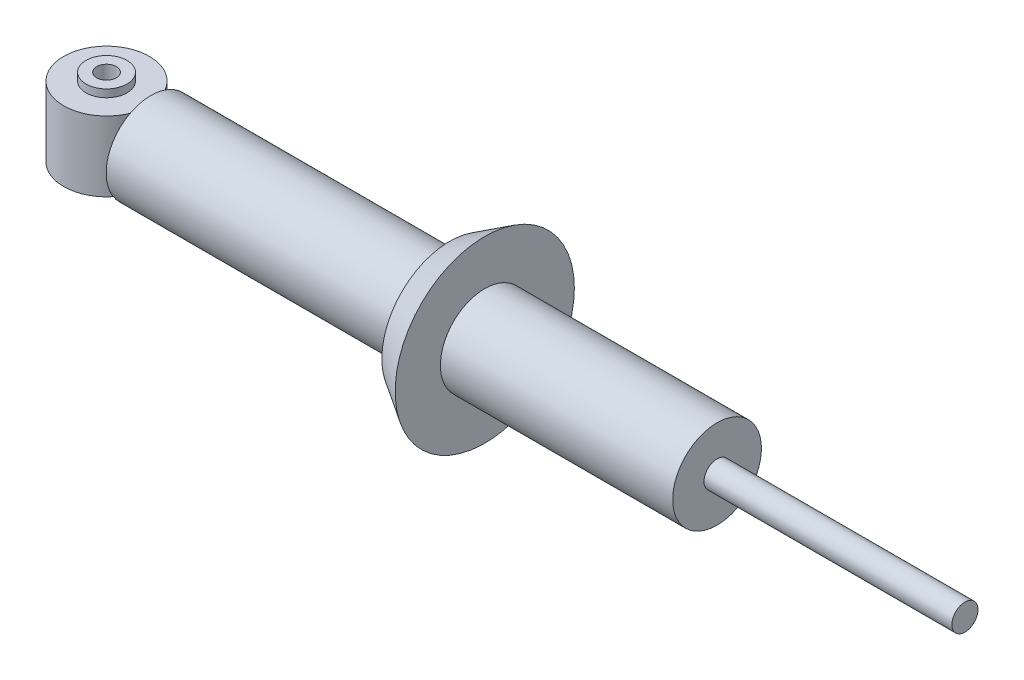
ISO-10303-21;
HEADER;
FILE_DESCRIPTION(('STEP AP214'),'2;1');
FILE_NAME('part.step','',(''),(''),'','','');
FILE_SCHEMA(('AUTOMOTIVE_DESIGN { 1 0 10303 214 1 1 1 1 }'));
ENDSEC;
DATA;
#1=APPLICATION_CONTEXT('core data for automotive mechanical design processes');
#2=APPLICATION_PROTOCOL_DEFINITION('international standard','automotive_design',2000,#1);
#3=PRODUCT_CONTEXT('',#1,'mechanical');
#4=PRODUCT('Part','Part','',(#3));
#5=PRODUCT_RELATED_PRODUCT_CATEGORY('part','',(#4));
#6=PRODUCT_DEFINITION_FORMATION('','',#4);
#7=PRODUCT_DEFINITION_CONTEXT('part definition',#1,'design');
#8=PRODUCT_DEFINITION('design','',#6,#7);
#9=PRODUCT_DEFINITION_SHAPE('','',#8);
#10=(LENGTH_UNIT() NAMED_UNIT(*) SI_UNIT(.MILLI.,.METRE.));
#11=(NAMED_UNIT(*) PLANE_ANGLE_UNIT() SI_UNIT($,.RADIAN.));
#12=(NAMED_UNIT(*) SI_UNIT($,.STERADIAN.) SOLID_ANGLE_UNIT());
#13=UNCERTAINTY_MEASURE_WITH_UNIT(LENGTH_MEASURE(1.E-05),#10,'distance_accuracy_value','');
#14=(GEOMETRIC_REPRESENTATION_CONTEXT(3) GLOBAL_UNCERTAINTY_ASSIGNED_CONTEXT((#13)) GLOBAL_UNIT_ASSIGNED_CONTEXT((#10,
#11,#12)) REPRESENTATION_CONTEXT('',''));
#15=CARTESIAN_POINT('',(0.,0.,0.));
#16=DIRECTION('',(0.,0.,1.));
#17=DIRECTION('',(1.,0.,0.));
#18=AXIS2_PLACEMENT_3D('',#15,#16,#17);
#19=CARTESIAN_POINT('',(26.,0.,0.));
#20=DIRECTION('',(1.,0.,0.));
#21=DIRECTION('',(0.,0.,-1.));
#22=AXIS2_PLACEMENT_3D('',#19,#20,#21);
#23=CYLINDRICAL_SURFACE('',#22,26.2);
#24=CARTESIAN_POINT('',(26.,0.,0.));
#25=DIRECTION('',(1.,0.,0.));
#26=DIRECTION('',(0.,0.,-1.));
#27=AXIS2_PLACEMENT_3D('',#24,#25,#26);
#28=CIRCLE('',#27,26.2);
#29=CARTESIAN_POINT('',(26.,0.,-26.2));
#30=VERTEX_POINT('',#29);
#31=EDGE_CURVE('E12',#30,#30,#28,.T.);
#32=ORIENTED_EDGE('',*,*,#31,.T.);
#33=EDGE_LOOP('',(#32));
#34=FACE_BOUND('',#33,.T.);
#35=CARTESIAN_POINT('',(201.,0.,0.));
#36=DIRECTION('',(1.,0.,0.));
#37=DIRECTION('',(0.,0.,-1.));
#38=AXIS2_PLACEMENT_3D('',#35,#36,#37);
#39=CIRCLE('',#38,26.2);
#40=CARTESIAN_POINT('',(201.,0.,-26.2));
#41=VERTEX_POINT('',#40);
#42=EDGE_CURVE('E50',#41,#41,#39,.T.);
#43=ORIENTED_EDGE('',*,*,#42,.F.);
#44=EDGE_LOOP('',(#43));
#45=FACE_BOUND('',#44,.T.);
#46=ADVANCED_FACE('F47',(#34,#45),#23,.T.);
#47=CARTESIAN_POINT('',(26.,0.,0.));
#48=DIRECTION('',(1.,0.,0.));
#49=DIRECTION('',(0.,0.,-1.));
#50=AXIS2_PLACEMENT_3D('',#47,#48,#49);
#51=PLANE('',#50);
#52=ORIENTED_EDGE('',*,*,#31,.F.);
#53=EDGE_LOOP('',(#52));
#54=FACE_BOUND('',#53,.T.);
#55=ADVANCED_FACE('F79',(#54),#51,.F.);
#56=CARTESIAN_POINT('',(221.6,0.,0.));
#57=DIRECTION('',(1.,0.,0.));
#58=DIRECTION('',(0.,0.,-1.));
#59=AXIS2_PLACEMENT_3D('',#56,#57,#58);
#60=PLANE('',#59);
#61=CARTESIAN_POINT('',(221.6,0.,0.));
#62=DIRECTION('',(1.,0.,0.));
#63=DIRECTION('',(0.,0.,-1.));
#64=AXIS2_PLACEMENT_3D('',#61,#62,#63);
#65=CIRCLE('',#64,26.);
#66=CARTESIAN_POINT('',(221.6,0.,-26.));
#67=VERTEX_POINT('',#66);
#68=EDGE_CURVE('E101',#67,#67,#65,.T.);
#69=ORIENTED_EDGE('',*,*,#68,.F.);
#70=EDGE_LOOP('',(#69));
#71=FACE_BOUND('',#70,.T.);
#72=CARTESIAN_POINT('',(221.6,0.,0.));
#73=DIRECTION('',(1.,0.,0.));
#74=DIRECTION('',(0.,0.,-1.));
#75=AXIS2_PLACEMENT_3D('',#72,#73,#74);
#76=CIRCLE('',#75,52.5);
#77=CARTESIAN_POINT('',(221.6,0.,-52.5));
#78=VERTEX_POINT('',#77);
#79=EDGE_CURVE('E57',#78,#78,#76,.T.);
#80=ORIENTED_EDGE('',*,*,#79,.T.);
#81=EDGE_LOOP('',(#80));
#82=FACE_BOUND('',#81,.T.);
#83=ADVANCED_FACE('F69',(#71,#82),#60,.T.);
#84=CARTESIAN_POINT('',(201.,0.,0.));
#85=DIRECTION('',(1.,0.,0.));
#86=DIRECTION('',(0.,0.,-1.));
#87=AXIS2_PLACEMENT_3D('',#84,#85,#86);
#88=PLANE('',#87);
#89=ORIENTED_EDGE('',*,*,#42,.T.);
#90=EDGE_LOOP('',(#89));
#91=FACE_BOUND('',#90,.T.);
#92=CARTESIAN_POINT('',(201.,0.,0.));
#93=DIRECTION('',(1.,0.,0.));
#94=DIRECTION('',(0.,0.,-1.));
#95=AXIS2_PLACEMENT_3D('',#92,#93,#94);
#96=CIRCLE('',#95,39.7);
#97=CARTESIAN_POINT('',(201.,0.,-39.7));
#98=VERTEX_POINT('',#97);
#99=EDGE_CURVE('E63',#98,#98,#96,.T.);
#100=ORIENTED_EDGE('',*,*,#99,.F.);
#101=EDGE_LOOP('',(#100));
#102=FACE_BOUND('',#101,.T.);
#103=ADVANCED_FACE('F78',(#91,#102),#88,.F.);
#104=CARTESIAN_POINT('',(201.,0.,0.));
#105=DIRECTION('',(1.,0.,0.));
#106=DIRECTION('',(0.,0.,-1.));
#107=AXIS2_PLACEMENT_3D('',#104,#105,#106);
#108=CONICAL_SURFACE('',#107,39.7,0.555976943732405);
#109=ORIENTED_EDGE('',*,*,#99,.T.);
#110=EDGE_LOOP('',(#109));
#111=FACE_BOUND('',#110,.T.);
#112=ORIENTED_EDGE('',*,*,#79,.F.);
#113=EDGE_LOOP('',(#112));
#114=FACE_BOUND('',#113,.T.);
#115=ADVANCED_FACE('F81',(#111,#114),#108,.T.);
#116=CARTESIAN_POINT('',(357.7,0.,0.));
#117=DIRECTION('',(-1.,0.,0.));
#118=DIRECTION('',(0.,0.,1.));
#119=AXIS2_PLACEMENT_3D('',#116,#117,#118);
#120=CYLINDRICAL_SURFACE('',#119,26.);
#121=CARTESIAN_POINT('',(357.7,0.,0.));
#122=DIRECTION('',(1.,0.,0.));
#123=DIRECTION('',(0.,0.,-1.));
#124=AXIS2_PLACEMENT_3D('',#121,#122,#123);
#125=CIRCLE('',#124,26.);
#126=CARTESIAN_POINT('',(357.7,0.,-26.));
#127=VERTEX_POINT('',#126);
#128=EDGE_CURVE('E99',#127,#127,#125,.T.);
#129=ORIENTED_EDGE('',*,*,#128,.F.);
#130=EDGE_LOOP('',(#129));
#131=FACE_BOUND('',#130,.T.);
#132=ORIENTED_EDGE('',*,*,#68,.T.);
#133=EDGE_LOOP('',(#132));
#134=FACE_BOUND('',#133,.T.);
#135=ADVANCED_FACE('F135',(#131,#134),#120,.T.);
#136=CARTESIAN_POINT('',(357.7,0.,0.));
#137=DIRECTION('',(1.,0.,0.));
#138=DIRECTION('',(0.,0.,-1.));
#139=AXIS2_PLACEMENT_3D('',#136,#137,#138);
#140=PLANE('',#139);
#141=CARTESIAN_POINT('',(357.7,0.,0.));
#142=DIRECTION('',(1.,0.,0.));
#143=DIRECTION('',(0.,0.,-1.));
#144=AXIS2_PLACEMENT_3D('',#141,#142,#143);
#145=CIRCLE('',#144,7.65);
#146=CARTESIAN_POINT('',(357.7,0.,-7.65));
#147=VERTEX_POINT('',#146);
#148=EDGE_CURVE('E118',#147,#147,#145,.T.);
#149=ORIENTED_EDGE('',*,*,#148,.F.);
#150=EDGE_LOOP('',(#149));
#151=FACE_BOUND('',#150,.T.);
#152=ORIENTED_EDGE('',*,*,#128,.T.);
#153=EDGE_LOOP('',(#152));
#154=FACE_BOUND('',#153,.T.);
#155=ADVANCED_FACE('F129',(#151,#154),#140,.T.);
#156=CARTESIAN_POINT('',(502.93,0.,0.));
#157=DIRECTION('',(-1.,0.,0.));
#158=DIRECTION('',(0.,0.,1.));
#159=AXIS2_PLACEMENT_3D('',#156,#157,#158);
#160=CYLINDRICAL_SURFACE('',#159,7.65);
#161=CARTESIAN_POINT('',(502.93,0.,0.));
#162=DIRECTION('',(1.,0.,0.));
#163=DIRECTION('',(0.,0.,-1.));
#164=AXIS2_PLACEMENT_3D('',#161,#162,#163);
#165=CIRCLE('',#164,7.65);
#166=CARTESIAN_POINT('',(502.93,0.,-7.65));
#167=VERTEX_POINT('',#166);
#168=EDGE_CURVE('E116',#167,#167,#165,.T.);
#169=ORIENTED_EDGE('',*,*,#168,.F.);
#170=EDGE_LOOP('',(#169));
#171=FACE_BOUND('',#170,.T.);
#172=ORIENTED_EDGE('',*,*,#148,.T.);
#173=EDGE_LOOP('',(#172));
#174=FACE_BOUND('',#173,.T.);
#175=ADVANCED_FACE('F126',(#171,#174),#160,.T.);
#176=CARTESIAN_POINT('',(502.93,0.,0.));
#177=DIRECTION('',(1.,0.,0.));
#178=DIRECTION('',(0.,0.,-1.));
#179=AXIS2_PLACEMENT_3D('',#176,#177,#178);
#180=PLANE('',#179);
#181=ORIENTED_EDGE('',*,*,#168,.T.);
#182=EDGE_LOOP('',(#181));
#183=FACE_BOUND('',#182,.T.);
#184=ADVANCED_FACE('F124',(#183),#180,.T.);
#185=CLOSED_SHELL('',(#46,#55,#83,#103,#115,#135,#155,#175,#184));
#186=MANIFOLD_SOLID_BREP('B2',#185);
#187=CARTESIAN_POINT('',(0.,58.9394201686436,0.));
#188=DIRECTION('',(0.,1.,0.));
#189=DIRECTION('',(0.,0.,1.));
#190=AXIS2_PLACEMENT_3D('',#187,#188,#189);
#191=CYLINDRICAL_SURFACE('',#190,5.75);
#192=CARTESIAN_POINT('',(0.,25.,0.));
#193=DIRECTION('',(0.,1.,0.));
#194=DIRECTION('',(0.,0.,1.));
#195=AXIS2_PLACEMENT_3D('',#192,#193,#194);
#196=CIRCLE('',#195,5.75);
#197=CARTESIAN_POINT('',(0.,25.,5.75));
#198=VERTEX_POINT('',#197);
#199=EDGE_CURVE('E264',#198,#198,#196,.T.);
#200=ORIENTED_EDGE('',*,*,#199,.T.);
#201=EDGE_LOOP('',(#200));
#202=FACE_BOUND('',#201,.T.);
#203=CARTESIAN_POINT('',(0.,-25.,0.));
#204=DIRECTION('',(0.,1.,0.));
#205=DIRECTION('',(0.,0.,1.));
#206=AXIS2_PLACEMENT_3D('',#203,#204,#205);
#207=CIRCLE('',#206,5.75);
#208=CARTESIAN_POINT('',(0.,-25.,5.75));
#209=VERTEX_POINT('',#208);
#210=EDGE_CURVE('E288',#209,#209,#207,.T.);
#211=ORIENTED_EDGE('',*,*,#210,.F.);
#212=EDGE_LOOP('',(#211));
#213=FACE_BOUND('',#212,.T.);
#214=ADVANCED_FACE('F200',(#202,#213),#191,.F.);
#215=CARTESIAN_POINT('',(-5.75,-25.,0.));
#216=DIRECTION('',(0.,-1.,0.));
#217=DIRECTION('',(0.,0.,-1.));
#218=AXIS2_PLACEMENT_3D('',#215,#216,#217);
#219=PLANE('',#218);
#220=ORIENTED_EDGE('',*,*,#210,.T.);
#221=EDGE_LOOP('',(#220));
#222=FACE_BOUND('',#221,.T.);
#223=CARTESIAN_POINT('',(0.,-25.,0.));
#224=DIRECTION('',(0.,1.,0.));
#225=DIRECTION('',(0.,0.,1.));
#226=AXIS2_PLACEMENT_3D('',#223,#224,#225);
#227=CIRCLE('',#226,12.);
#228=CARTESIAN_POINT('',(0.,-25.,12.));
#229=VERTEX_POINT('',#228);
#230=EDGE_CURVE('E285',#229,#229,#227,.T.);
#231=ORIENTED_EDGE('',*,*,#230,.F.);
#232=EDGE_LOOP('',(#231));
#233=FACE_BOUND('',#232,.T.);
#234=ADVANCED_FACE('F328',(#222,#233),#219,.T.);
#235=CARTESIAN_POINT('',(0.,58.9394201686436,0.));
#236=DIRECTION('',(0.,1.,0.));
#237=DIRECTION('',(0.,0.,1.));
#238=AXIS2_PLACEMENT_3D('',#235,#236,#237);
#239=CYLINDRICAL_SURFACE('',#238,12.);
#240=ORIENTED_EDGE('',*,*,#230,.T.);
#241=EDGE_LOOP('',(#240));
#242=FACE_BOUND('',#241,.T.);
#243=CARTESIAN_POINT('',(0.,-20.5,0.));
#244=DIRECTION('',(0.,1.,0.));
#245=DIRECTION('',(0.,0.,1.));
#246=AXIS2_PLACEMENT_3D('',#243,#244,#245);
#247=CIRCLE('',#246,12.);
#248=CARTESIAN_POINT('',(0.,-20.5,12.));
#249=VERTEX_POINT('',#248);
#250=EDGE_CURVE('E282',#249,#249,#247,.T.);
#251=ORIENTED_EDGE('',*,*,#250,.F.);
#252=EDGE_LOOP('',(#251));
#253=FACE_BOUND('',#252,.T.);
#254=ADVANCED_FACE('F333',(#242,#253),#239,.T.);
#255=CARTESIAN_POINT('',(-12.,-20.5,0.));
#256=DIRECTION('',(0.,-1.,0.));
#257=DIRECTION('',(0.,0.,-1.));
#258=AXIS2_PLACEMENT_3D('',#255,#256,#257);
#259=PLANE('',#258);
#260=ORIENTED_EDGE('',*,*,#250,.T.);
#261=EDGE_LOOP('',(#260));
#262=FACE_BOUND('',#261,.T.);
#263=CARTESIAN_POINT('',(0.,-20.5,0.));
#264=DIRECTION('',(0.,1.,0.));
#265=DIRECTION('',(0.,0.,1.));
#266=AXIS2_PLACEMENT_3D('',#263,#264,#265);
#267=CIRCLE('',#266,25.1);
#268=CARTESIAN_POINT('',(0.,-20.5,25.1));
#269=VERTEX_POINT('',#268);
#270=EDGE_CURVE('E279',#269,#269,#267,.T.);
#271=ORIENTED_EDGE('',*,*,#270,.F.);
#272=EDGE_LOOP('',(#271));
#273=FACE_BOUND('',#272,.T.);
#274=ADVANCED_FACE('F303',(#262,#273),#259,.T.);
#275=CARTESIAN_POINT('',(0.,58.9394201686436,0.));
#276=DIRECTION('',(0.,1.,0.));
#277=DIRECTION('',(0.,0.,1.));
#278=AXIS2_PLACEMENT_3D('',#275,#276,#277);
#279=CYLINDRICAL_SURFACE('',#278,25.1);
#280=CARTESIAN_POINT('',(0.,10.,0.));
#281=DIRECTION('',(0.,1.,0.));
#282=DIRECTION('',(0.,0.,1.));
#283=AXIS2_PLACEMENT_3D('',#280,#281,#282);
#284=CIRCLE('',#283,25.1);
#285=CARTESIAN_POINT('',(23.0219460515396,10.,-9.99999999999999));
#286=VERTEX_POINT('',#285);
#287=CARTESIAN_POINT('',(23.0219460515396,10.,10.));
#288=VERTEX_POINT('',#287);
#289=EDGE_CURVE('E45',#286,#288,#284,.F.);
#290=ORIENTED_EDGE('',*,*,#289,.F.);
#291=DIRECTION('',(0.,1.,0.));
#292=VECTOR('',#291,1.);
#293=CARTESIAN_POINT('',(23.0219460515396,58.9394201686436,-9.99999999999999));
#294=LINE('',#293,#292);
#295=CARTESIAN_POINT('',(23.0219460515396,-10.,-10.));
#296=VERTEX_POINT('',#295);
#297=EDGE_CURVE('E207',#296,#286,#294,.T.);
#298=ORIENTED_EDGE('',*,*,#297,.F.);
#299=CARTESIAN_POINT('',(0.,-10.,0.));
#300=DIRECTION('',(0.,-1.,0.));
#301=DIRECTION('',(0.,0.,-1.));
#302=AXIS2_PLACEMENT_3D('',#299,#300,#301);
#303=CIRCLE('',#302,25.1);
#304=CARTESIAN_POINT('',(23.0219460515396,-10.,10.));
#305=VERTEX_POINT('',#304);
#306=EDGE_CURVE('E293',#305,#296,#303,.F.);
#307=ORIENTED_EDGE('',*,*,#306,.F.);
#308=DIRECTION('',(0.,1.,0.));
#309=VECTOR('',#308,1.);
#310=CARTESIAN_POINT('',(23.0219460515396,58.9394201686436,10.));
#311=LINE('',#310,#309);
#312=EDGE_CURVE('E291',#288,#305,#311,.F.);
#313=ORIENTED_EDGE('',*,*,#312,.F.);
#314=EDGE_LOOP('',(#290,#298,#307,#313));
#315=FACE_BOUND('',#314,.T.);
#316=ORIENTED_EDGE('',*,*,#270,.T.);
#317=EDGE_LOOP('',(#316));
#318=FACE_BOUND('',#317,.T.);
#319=CARTESIAN_POINT('',(0.,20.5,0.));
#320=DIRECTION('',(0.,1.,0.));
#321=DIRECTION('',(0.,0.,1.));
#322=AXIS2_PLACEMENT_3D('',#319,#320,#321);
#323=CIRCLE('',#322,25.1);
#324=CARTESIAN_POINT('',(0.,20.5,25.1));
#325=VERTEX_POINT('',#324);
#326=EDGE_CURVE('E276',#325,#325,#323,.T.);
#327=ORIENTED_EDGE('',*,*,#326,.F.);
#328=EDGE_LOOP('',(#327));
#329=FACE_BOUND('',#328,.T.);
#330=ADVANCED_FACE('F299',(#315,#318,#329),#279,.T.);
#331=CARTESIAN_POINT('',(-12.,20.5,0.));
#332=DIRECTION('',(0.,1.,0.));
#333=DIRECTION('',(0.,0.,1.));
#334=AXIS2_PLACEMENT_3D('',#331,#332,#333);
#335=PLANE('',#334);
#336=ORIENTED_EDGE('',*,*,#326,.T.);
#337=EDGE_LOOP('',(#336));
#338=FACE_BOUND('',#337,.T.);
#339=CARTESIAN_POINT('',(0.,20.5,0.));
#340=DIRECTION('',(0.,1.,0.));
#341=DIRECTION('',(0.,0.,1.));
#342=AXIS2_PLACEMENT_3D('',#339,#340,#341);
#343=CIRCLE('',#342,12.);
#344=CARTESIAN_POINT('',(0.,20.5,12.));
#345=VERTEX_POINT('',#344);
#346=EDGE_CURVE('E273',#345,#345,#343,.T.);
#347=ORIENTED_EDGE('',*,*,#346,.F.);
#348=EDGE_LOOP('',(#347));
#349=FACE_BOUND('',#348,.T.);
#350=ADVANCED_FACE('F302',(#338,#349),#335,.T.);
#351=CARTESIAN_POINT('',(0.,58.9394201686436,0.));
#352=DIRECTION('',(0.,1.,0.));
#353=DIRECTION('',(0.,0.,1.));
#354=AXIS2_PLACEMENT_3D('',#351,#352,#353);
#355=CYLINDRICAL_SURFACE('',#354,12.);
#356=ORIENTED_EDGE('',*,*,#346,.T.);
#357=EDGE_LOOP('',(#356));
#358=FACE_BOUND('',#357,.T.);
#359=CARTESIAN_POINT('',(0.,25.,0.));
#360=DIRECTION('',(0.,1.,0.));
#361=DIRECTION('',(0.,0.,1.));
#362=AXIS2_PLACEMENT_3D('',#359,#360,#361);
#363=CIRCLE('',#362,12.);
#364=CARTESIAN_POINT('',(0.,25.,12.));
#365=VERTEX_POINT('',#364);
#366=EDGE_CURVE('E270',#365,#365,#363,.T.);
#367=ORIENTED_EDGE('',*,*,#366,.F.);
#368=EDGE_LOOP('',(#367));
#369=FACE_BOUND('',#368,.T.);
#370=ADVANCED_FACE('F311',(#358,#369),#355,.T.);
#371=CARTESIAN_POINT('',(-5.75,25.,0.));
#372=DIRECTION('',(0.,1.,0.));
#373=DIRECTION('',(0.,0.,1.));
#374=AXIS2_PLACEMENT_3D('',#371,#372,#373);
#375=PLANE('',#374);
#376=ORIENTED_EDGE('',*,*,#366,.T.);
#377=EDGE_LOOP('',(#376));
#378=FACE_BOUND('',#377,.T.);
#379=ORIENTED_EDGE('',*,*,#199,.F.);
#380=EDGE_LOOP('',(#379));
#381=FACE_BOUND('',#380,.T.);
#382=ADVANCED_FACE('F317',(#378,#381),#375,.T.);
#383=CARTESIAN_POINT('',(23.,10.,10.));
#384=DIRECTION('',(0.,1.,0.));
#385=DIRECTION('',(0.,0.,1.));
#386=AXIS2_PLACEMENT_3D('',#383,#384,#385);
#387=PLANE('',#386);
#388=DIRECTION('',(1.,0.,0.));
#389=VECTOR('',#388,1.);
#390=CARTESIAN_POINT('',(23.,10.,-10.));
#391=LINE('',#390,#389);
#392=CARTESIAN_POINT('',(26.,10.,-10.));
#393=VERTEX_POINT('',#392);
#394=EDGE_CURVE('E262',#286,#393,#391,.T.);
#395=ORIENTED_EDGE('',*,*,#394,.F.);
#396=ORIENTED_EDGE('',*,*,#289,.T.);
#397=DIRECTION('',(1.,0.,0.));
#398=VECTOR('',#397,1.);
#399=CARTESIAN_POINT('',(23.,10.,10.));
#400=LINE('',#399,#398);
#401=CARTESIAN_POINT('',(26.,10.,10.));
#402=VERTEX_POINT('',#401);
#403=EDGE_CURVE('E235',#288,#402,#400,.T.);
#404=ORIENTED_EDGE('',*,*,#403,.T.);
#405=DIRECTION('',(0.,0.,1.));
#406=VECTOR('',#405,1.);
#407=CARTESIAN_POINT('',(26.,10.,10.));
#408=LINE('',#407,#406);
#409=EDGE_CURVE('E240',#393,#402,#408,.T.);
#410=ORIENTED_EDGE('',*,*,#409,.F.);
#411=EDGE_LOOP('',(#395,#396,#404,#410));
#412=FACE_BOUND('',#411,.T.);
#413=ADVANCED_FACE('F238',(#412),#387,.T.);
#414=CARTESIAN_POINT('',(23.,10.,-10.));
#415=DIRECTION('',(0.,0.,-1.));
#416=DIRECTION('',(0.,1.,0.));
#417=AXIS2_PLACEMENT_3D('',#414,#415,#416);
#418=PLANE('',#417);
#419=DIRECTION('',(1.,0.,0.));
#420=VECTOR('',#419,1.);
#421=CARTESIAN_POINT('',(23.,-10.,-10.));
#422=LINE('',#421,#420);
#423=CARTESIAN_POINT('',(26.,-10.,-10.));
#424=VERTEX_POINT('',#423);
#425=EDGE_CURVE('E265',#296,#424,#422,.T.);
#426=ORIENTED_EDGE('',*,*,#425,.F.);
#427=ORIENTED_EDGE('',*,*,#297,.T.);
#428=ORIENTED_EDGE('',*,*,#394,.T.);
#429=DIRECTION('',(0.,1.,0.));
#430=VECTOR('',#429,1.);
#431=CARTESIAN_POINT('',(26.,10.,-10.));
#432=LINE('',#431,#430);
#433=EDGE_CURVE('E245',#424,#393,#432,.T.);
#434=ORIENTED_EDGE('',*,*,#433,.F.);
#435=EDGE_LOOP('',(#426,#427,#428,#434));
#436=FACE_BOUND('',#435,.T.);
#437=ADVANCED_FACE('F296',(#436),#418,.T.);
#438=CARTESIAN_POINT('',(23.,-10.,-10.));
#439=DIRECTION('',(0.,-1.,0.));
#440=DIRECTION('',(0.,0.,-1.));
#441=AXIS2_PLACEMENT_3D('',#438,#439,#440);
#442=PLANE('',#441);
#443=DIRECTION('',(1.,0.,0.));
#444=VECTOR('',#443,1.);
#445=CARTESIAN_POINT('',(23.,-10.,10.));
#446=LINE('',#445,#444);
#447=CARTESIAN_POINT('',(26.,-10.,10.));
#448=VERTEX_POINT('',#447);
#449=EDGE_CURVE('E244',#305,#448,#446,.T.);
#450=ORIENTED_EDGE('',*,*,#449,.F.);
#451=ORIENTED_EDGE('',*,*,#306,.T.);
#452=ORIENTED_EDGE('',*,*,#425,.T.);
#453=DIRECTION('',(0.,0.,-1.));
#454=VECTOR('',#453,1.);
#455=CARTESIAN_POINT('',(26.,-10.,-10.));
#456=LINE('',#455,#454);
#457=EDGE_CURVE('E254',#448,#424,#456,.T.);
#458=ORIENTED_EDGE('',*,*,#457,.F.);
#459=EDGE_LOOP('',(#450,#451,#452,#458));
#460=FACE_BOUND('',#459,.T.);
#461=ADVANCED_FACE('F298',(#460),#442,.T.);
#462=CARTESIAN_POINT('',(23.,-10.,10.));
#463=DIRECTION('',(0.,0.,1.));
#464=DIRECTION('',(1.,0.,0.));
#465=AXIS2_PLACEMENT_3D('',#462,#463,#464);
#466=PLANE('',#465);
#467=ORIENTED_EDGE('',*,*,#403,.F.);
#468=ORIENTED_EDGE('',*,*,#312,.T.);
#469=ORIENTED_EDGE('',*,*,#449,.T.);
#470=DIRECTION('',(0.,-1.,0.));
#471=VECTOR('',#470,1.);
#472=CARTESIAN_POINT('',(26.,-10.,10.));
#473=LINE('',#472,#471);
#474=EDGE_CURVE('E248',#402,#448,#473,.T.);
#475=ORIENTED_EDGE('',*,*,#474,.F.);
#476=EDGE_LOOP('',(#467,#468,#469,#475));
#477=FACE_BOUND('',#476,.T.);
#478=ADVANCED_FACE('F249',(#477),#466,.T.);
#479=CARTESIAN_POINT('',(26.,0.,0.));
#480=DIRECTION('',(-1.,0.,0.));
#481=DIRECTION('',(0.,0.,1.));
#482=AXIS2_PLACEMENT_3D('',#479,#480,#481);
#483=PLANE('',#482);
#484=ORIENTED_EDGE('',*,*,#409,.T.);
#485=ORIENTED_EDGE('',*,*,#474,.T.);
#486=ORIENTED_EDGE('',*,*,#457,.T.);
#487=ORIENTED_EDGE('',*,*,#433,.T.);
#488=EDGE_LOOP('',(#484,#485,#486,#487));
#489=FACE_BOUND('',#488,.T.);
#490=ADVANCED_FACE('F256',(#489),#483,.F.);
#491=CLOSED_SHELL('',(#214,#234,#254,#274,#330,#350,#370,#382,#413,#437,#461,#478,#490));
#492=MANIFOLD_SOLID_BREP('B7',#491);
#493=ADVANCED_BREP_SHAPE_REPRESENTATION('',(#18,#186,#492),#14);
#494=SHAPE_DEFINITION_REPRESENTATION(#9,#493);
ENDSEC;
END-ISO-10303-21;
